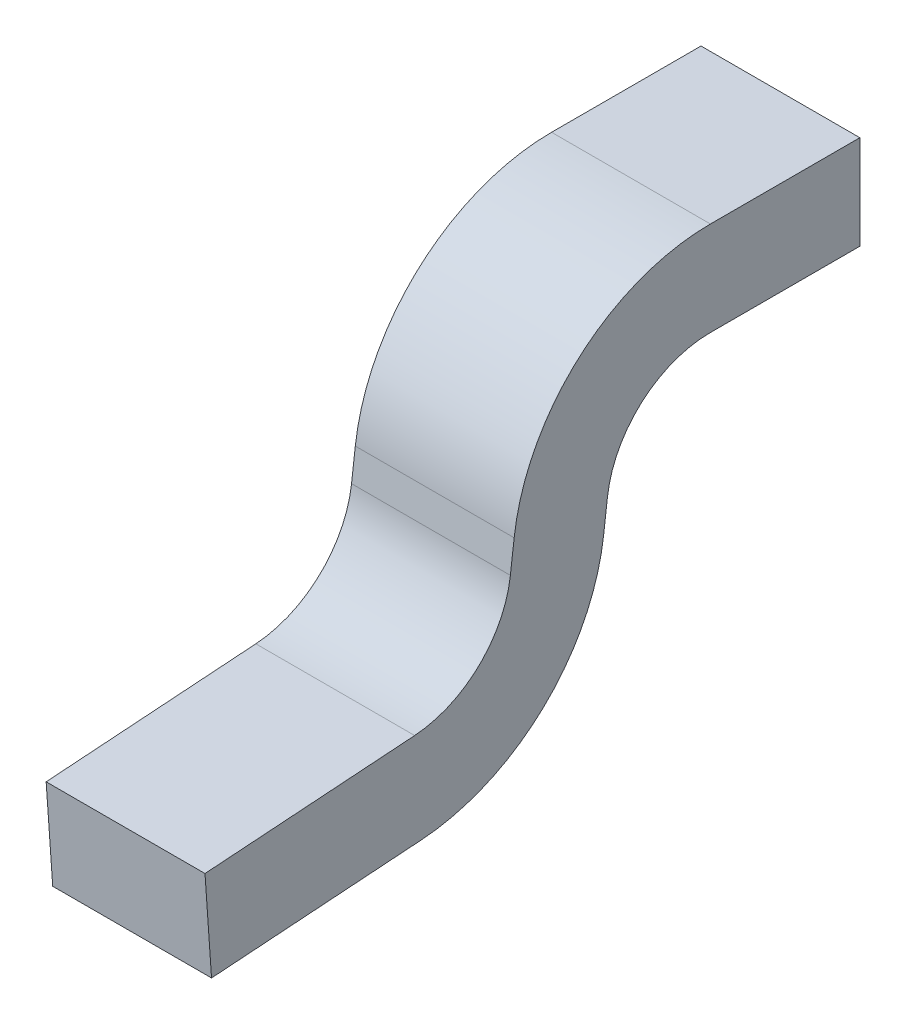
ISO-10303-21;
HEADER;
FILE_DESCRIPTION(('STEP AP214'),'2;1');
FILE_NAME('part.step','',(''),(''),'','','');
FILE_SCHEMA(('AUTOMOTIVE_DESIGN { 1 0 10303 214 1 1 1 1 }'));
ENDSEC;
DATA;
#1=APPLICATION_CONTEXT('core data for automotive mechanical design processes');
#2=APPLICATION_PROTOCOL_DEFINITION('international standard','automotive_design',2000,#1);
#3=PRODUCT_CONTEXT('',#1,'mechanical');
#4=PRODUCT('Part','Part','',(#3));
#5=PRODUCT_RELATED_PRODUCT_CATEGORY('part','',(#4));
#6=PRODUCT_DEFINITION_FORMATION('','',#4);
#7=PRODUCT_DEFINITION_CONTEXT('part definition',#1,'design');
#8=PRODUCT_DEFINITION('design','',#6,#7);
#9=PRODUCT_DEFINITION_SHAPE('','',#8);
#10=(LENGTH_UNIT() NAMED_UNIT(*) SI_UNIT(.MILLI.,.METRE.));
#11=(NAMED_UNIT(*) PLANE_ANGLE_UNIT() SI_UNIT($,.RADIAN.));
#12=(NAMED_UNIT(*) SI_UNIT($,.STERADIAN.) SOLID_ANGLE_UNIT());
#13=UNCERTAINTY_MEASURE_WITH_UNIT(LENGTH_MEASURE(1.E-05),#10,'distance_accuracy_value','');
#14=(GEOMETRIC_REPRESENTATION_CONTEXT(3) GLOBAL_UNCERTAINTY_ASSIGNED_CONTEXT((#13)) GLOBAL_UNIT_ASSIGNED_CONTEXT((#10,
#11,#12)) REPRESENTATION_CONTEXT('',''));
#15=CARTESIAN_POINT('',(0.,0.,0.));
#16=DIRECTION('',(0.,0.,1.));
#17=DIRECTION('',(1.,0.,0.));
#18=AXIS2_PLACEMENT_3D('',#15,#16,#17);
#19=CARTESIAN_POINT('',(0.1225,0.,0.));
#20=DIRECTION('',(1.,0.,0.));
#21=DIRECTION('',(0.,0.,-1.));
#22=AXIS2_PLACEMENT_3D('',#19,#20,#21);
#23=PLANE('',#22);
#24=CARTESIAN_POINT('',(0.1225,0.0675,-0.1694895299344));
#25=DIRECTION('',(-1.,0.,0.));
#26=DIRECTION('',(0.,0.,1.));
#27=AXIS2_PLACEMENT_3D('',#24,#25,#26);
#28=CIRCLE('',#27,0.305);
#29=CARTESIAN_POINT('',(0.1225,0.104670149738584,0.133237046316252));
#30=VERTEX_POINT('',#29);
#31=CARTESIAN_POINT('',(0.1225,0.3725,-0.1694895299344));
#32=VERTEX_POINT('',#31);
#33=EDGE_CURVE('E195',#30,#32,#28,.T.);
#34=ORIENTED_EDGE('',*,*,#33,.F.);
#35=DIRECTION('',(0.,-0.992546151641328,0.121869343405103));
#36=VECTOR('',#35,1.);
#37=CARTESIAN_POINT('',(0.1225,0.01767105479375,0.143919191988));
#38=LINE('',#37,#36);
#39=CARTESIAN_POINT('',(0.1225,0.0573739531898198,0.139044289041878));
#40=VERTEX_POINT('',#39);
#41=EDGE_CURVE('E192',#40,#30,#38,.F.);
#42=ORIENTED_EDGE('',*,*,#41,.F.);
#43=CARTESIAN_POINT('',(0.1225,0.07687304813464,0.2978516733045));
#44=DIRECTION('',(1.,0.,0.));
#45=DIRECTION('',(0.,0.,-1.));
#46=AXIS2_PLACEMENT_3D('',#43,#44,#45);
#47=CIRCLE('',#46,0.16);
#48=CARTESIAN_POINT('',(0.1225,-0.0827371999069275,0.28669063750542));
#49=VERTEX_POINT('',#48);
#50=EDGE_CURVE('E189',#40,#49,#47,.F.);
#51=ORIENTED_EDGE('',*,*,#50,.T.);
#52=DIRECTION('',(0.,-0.0697564737441317,0.997564050259824));
#53=VECTOR('',#52,1.);
#54=CARTESIAN_POINT('',(0.1225,-0.07353675199435,0.1551181024954));
#55=LINE('',#54,#53);
#56=CARTESIAN_POINT('',(0.1225,-0.105353212712308,0.610114688692899));
#57=VERTEX_POINT('',#56);
#58=EDGE_CURVE('E185',#57,#49,#55,.F.);
#59=ORIENTED_EDGE('',*,*,#58,.F.);
#60=DIRECTION('',(0.,-0.997564050259825,-0.0697564737441217));
#61=VECTOR('',#60,1.);
#62=CARTESIAN_POINT('',(0.1225,-0.1053532127123,0.6101146886929));
#63=LINE('',#62,#61);
#64=CARTESIAN_POINT('',(0.1225,-0.25,0.6));
#65=VERTEX_POINT('',#64);
#66=EDGE_CURVE('E125',#65,#57,#63,.F.);
#67=ORIENTED_EDGE('',*,*,#66,.F.);
#68=DIRECTION('',(0.,0.0697564737441317,-0.997564050259824));
#69=VECTOR('',#68,1.);
#70=CARTESIAN_POINT('',(0.1225,-0.25,0.6));
#71=LINE('',#70,#69);
#72=CARTESIAN_POINT('',(0.1225,-0.227383987194604,0.27657594881252));
#73=VERTEX_POINT('',#72);
#74=EDGE_CURVE('E129',#73,#65,#71,.F.);
#75=ORIENTED_EDGE('',*,*,#74,.F.);
#76=CARTESIAN_POINT('',(0.1225,0.07687304813464,0.2978516733045));
#77=DIRECTION('',(-1.,0.,0.));
#78=DIRECTION('',(0.,0.,1.));
#79=AXIS2_PLACEMENT_3D('',#76,#77,#78);
#80=CIRCLE('',#79,0.305);
#81=CARTESIAN_POINT('',(0.1225,0.0397028983960769,-0.00487490294611844));
#82=VERTEX_POINT('',#81);
#83=EDGE_CURVE('E173',#82,#73,#80,.T.);
#84=ORIENTED_EDGE('',*,*,#83,.F.);
#85=DIRECTION('',(0.,0.992546151641328,-0.121869343405103));
#86=VECTOR('',#85,1.);
#87=CARTESIAN_POINT('',(0.1225,-0.2098456333613,0.02576580394965));
#88=LINE('',#87,#86);
#89=CARTESIAN_POINT('',(0.1225,0.0869990949448186,-0.0106821456717666));
#90=VERTEX_POINT('',#89);
#91=EDGE_CURVE('E89',#90,#82,#88,.F.);
#92=ORIENTED_EDGE('',*,*,#91,.F.);
#93=CARTESIAN_POINT('',(0.1225,0.0675,-0.1694895299344));
#94=DIRECTION('',(1.,0.,0.));
#95=DIRECTION('',(0.,0.,-1.));
#96=AXIS2_PLACEMENT_3D('',#93,#94,#95);
#97=CIRCLE('',#96,0.16);
#98=CARTESIAN_POINT('',(0.1225,0.2275,-0.1694895299344));
#99=VERTEX_POINT('',#98);
#100=EDGE_CURVE('E19',#90,#99,#97,.F.);
#101=ORIENTED_EDGE('',*,*,#100,.T.);
#102=DIRECTION('',(0.,0.,-1.));
#103=VECTOR('',#102,1.);
#104=CARTESIAN_POINT('',(0.1225,0.2275,-0.02793348760541));
#105=LINE('',#104,#103);
#106=CARTESIAN_POINT('',(0.1225,0.2275,-0.4));
#107=VERTEX_POINT('',#106);
#108=EDGE_CURVE('E95',#107,#99,#105,.F.);
#109=ORIENTED_EDGE('',*,*,#108,.F.);
#110=DIRECTION('',(0.,1.,0.));
#111=VECTOR('',#110,1.);
#112=CARTESIAN_POINT('',(0.1225,0.2275,-0.4));
#113=LINE('',#112,#111);
#114=CARTESIAN_POINT('',(0.1225,0.3725,-0.4));
#115=VERTEX_POINT('',#114);
#116=EDGE_CURVE('E101',#115,#107,#113,.F.);
#117=ORIENTED_EDGE('',*,*,#116,.F.);
#118=DIRECTION('',(0.,0.,1.));
#119=VECTOR('',#118,1.);
#120=CARTESIAN_POINT('',(0.1225,0.3725,-0.4));
#121=LINE('',#120,#119);
#122=EDGE_CURVE('E107',#32,#115,#121,.F.);
#123=ORIENTED_EDGE('',*,*,#122,.F.);
#124=EDGE_LOOP('',(#34,#42,#51,#59,#67,#75,#84,#92,#101,#109,#117,#123));
#125=FACE_BOUND('',#124,.T.);
#126=ADVANCED_FACE('F16',(#125),#23,.T.);
#127=CARTESIAN_POINT('',(-0.1225,-0.2098456333613,0.02576580394965));
#128=DIRECTION('',(0.,-0.121869343405103,-0.992546151641328));
#129=DIRECTION('',(0.,0.992546151641328,-0.121869343405103));
#130=AXIS2_PLACEMENT_3D('',#127,#128,#129);
#131=PLANE('',#130);
#132=DIRECTION('',(1.,0.,0.));
#133=VECTOR('',#132,1.);
#134=CARTESIAN_POINT('',(-0.1225,0.0869990949448154,-0.0106821456717875));
#135=LINE('',#134,#133);
#136=CARTESIAN_POINT('',(-0.1225,0.0869990949448222,-0.0106821456717693));
#137=VERTEX_POINT('',#136);
#138=EDGE_CURVE('E210',#137,#90,#135,.T.);
#139=ORIENTED_EDGE('',*,*,#138,.T.);
#140=ORIENTED_EDGE('',*,*,#91,.T.);
#141=DIRECTION('',(-1.,0.,0.));
#142=VECTOR('',#141,1.);
#143=CARTESIAN_POINT('',(-0.1225,0.0397028983960738,-0.00487490294610366));
#144=LINE('',#143,#142);
#145=CARTESIAN_POINT('',(-0.1225,0.0397028983960693,-0.00487490294611852));
#146=VERTEX_POINT('',#145);
#147=EDGE_CURVE('E171',#146,#82,#144,.F.);
#148=ORIENTED_EDGE('',*,*,#147,.F.);
#149=DIRECTION('',(0.,0.992546151641321,-0.121869343405153));
#150=VECTOR('',#149,1.);
#151=CARTESIAN_POINT('',(-0.1225,0.03970289839607,-0.004874902946134));
#152=LINE('',#151,#150);
#153=EDGE_CURVE('E168',#146,#137,#152,.T.);
#154=ORIENTED_EDGE('',*,*,#153,.T.);
#155=EDGE_LOOP('',(#139,#140,#148,#154));
#156=FACE_BOUND('',#155,.T.);
#157=ADVANCED_FACE('F256',(#156),#131,.T.);
#158=CARTESIAN_POINT('',(-0.1225,0.0675,-0.1694895299344));
#159=DIRECTION('',(1.,0.,0.));
#160=DIRECTION('',(0.,0.,-1.));
#161=AXIS2_PLACEMENT_3D('',#158,#159,#160);
#162=CYLINDRICAL_SURFACE('',#161,0.16);
#163=ORIENTED_EDGE('',*,*,#138,.F.);
#164=CARTESIAN_POINT('',(-0.1225,0.0675,-0.1694895299344));
#165=DIRECTION('',(1.,0.,0.));
#166=DIRECTION('',(0.,0.,-1.));
#167=AXIS2_PLACEMENT_3D('',#164,#165,#166);
#168=CIRCLE('',#167,0.16);
#169=CARTESIAN_POINT('',(-0.1225,0.2275,-0.1694895299344));
#170=VERTEX_POINT('',#169);
#171=EDGE_CURVE('E165',#137,#170,#168,.F.);
#172=ORIENTED_EDGE('',*,*,#171,.T.);
#173=DIRECTION('',(1.,0.,0.));
#174=VECTOR('',#173,1.);
#175=CARTESIAN_POINT('',(-0.1225,0.2275,-0.1694895299344));
#176=LINE('',#175,#174);
#177=EDGE_CURVE('E208',#99,#170,#176,.F.);
#178=ORIENTED_EDGE('',*,*,#177,.F.);
#179=ORIENTED_EDGE('',*,*,#100,.F.);
#180=EDGE_LOOP('',(#163,#172,#178,#179));
#181=FACE_BOUND('',#180,.T.);
#182=ADVANCED_FACE('F254',(#181),#162,.F.);
#183=CARTESIAN_POINT('',(-0.1225,0.2275,-0.02793348760541));
#184=DIRECTION('',(0.,-1.,0.));
#185=DIRECTION('',(0.,0.,-1.));
#186=AXIS2_PLACEMENT_3D('',#183,#184,#185);
#187=PLANE('',#186);
#188=ORIENTED_EDGE('',*,*,#177,.T.);
#189=DIRECTION('',(0.,0.,-1.));
#190=VECTOR('',#189,1.);
#191=CARTESIAN_POINT('',(-0.1225,0.2275,0.));
#192=LINE('',#191,#190);
#193=CARTESIAN_POINT('',(-0.1225,0.2275,-0.4));
#194=VERTEX_POINT('',#193);
#195=EDGE_CURVE('E162',#170,#194,#192,.T.);
#196=ORIENTED_EDGE('',*,*,#195,.T.);
#197=DIRECTION('',(-1.,0.,0.));
#198=VECTOR('',#197,1.);
#199=CARTESIAN_POINT('',(-0.1225,0.2275,-0.4));
#200=LINE('',#199,#198);
#201=EDGE_CURVE('E204',#107,#194,#200,.T.);
#202=ORIENTED_EDGE('',*,*,#201,.F.);
#203=ORIENTED_EDGE('',*,*,#108,.T.);
#204=EDGE_LOOP('',(#188,#196,#202,#203));
#205=FACE_BOUND('',#204,.T.);
#206=ADVANCED_FACE('F250',(#205),#187,.T.);
#207=CARTESIAN_POINT('',(-0.1225,0.2275,-0.4));
#208=DIRECTION('',(0.,0.,-1.));
#209=DIRECTION('',(-1.,0.,0.));
#210=AXIS2_PLACEMENT_3D('',#207,#208,#209);
#211=PLANE('',#210);
#212=ORIENTED_EDGE('',*,*,#201,.T.);
#213=DIRECTION('',(0.,1.,0.));
#214=VECTOR('',#213,1.);
#215=CARTESIAN_POINT('',(-0.1225,0.,-0.4));
#216=LINE('',#215,#214);
#217=CARTESIAN_POINT('',(-0.1225,0.3725,-0.4));
#218=VERTEX_POINT('',#217);
#219=EDGE_CURVE('E159',#194,#218,#216,.T.);
#220=ORIENTED_EDGE('',*,*,#219,.T.);
#221=DIRECTION('',(1.,0.,0.));
#222=VECTOR('',#221,1.);
#223=CARTESIAN_POINT('',(-0.1225,0.3725,-0.4));
#224=LINE('',#223,#222);
#225=EDGE_CURVE('E196',#115,#218,#224,.F.);
#226=ORIENTED_EDGE('',*,*,#225,.F.);
#227=ORIENTED_EDGE('',*,*,#116,.T.);
#228=EDGE_LOOP('',(#212,#220,#226,#227));
#229=FACE_BOUND('',#228,.T.);
#230=ADVANCED_FACE('F249',(#229),#211,.T.);
#231=CARTESIAN_POINT('',(-0.1225,0.3725,-0.4));
#232=DIRECTION('',(0.,1.,0.));
#233=DIRECTION('',(0.,0.,1.));
#234=AXIS2_PLACEMENT_3D('',#231,#232,#233);
#235=PLANE('',#234);
#236=ORIENTED_EDGE('',*,*,#225,.T.);
#237=DIRECTION('',(0.,0.,-1.));
#238=VECTOR('',#237,1.);
#239=CARTESIAN_POINT('',(-0.1225,0.3725,0.));
#240=LINE('',#239,#238);
#241=CARTESIAN_POINT('',(-0.1225,0.3725,-0.1694895299344));
#242=VERTEX_POINT('',#241);
#243=EDGE_CURVE('E156',#218,#242,#240,.F.);
#244=ORIENTED_EDGE('',*,*,#243,.T.);
#245=DIRECTION('',(-1.,0.,0.));
#246=VECTOR('',#245,1.);
#247=CARTESIAN_POINT('',(-0.1225,0.3725,-0.1694895299344));
#248=LINE('',#247,#246);
#249=EDGE_CURVE('E193',#32,#242,#248,.T.);
#250=ORIENTED_EDGE('',*,*,#249,.F.);
#251=ORIENTED_EDGE('',*,*,#122,.T.);
#252=EDGE_LOOP('',(#236,#244,#250,#251));
#253=FACE_BOUND('',#252,.T.);
#254=ADVANCED_FACE('F244',(#253),#235,.T.);
#255=CARTESIAN_POINT('',(-0.1225,0.0675,-0.1694895299344));
#256=DIRECTION('',(-1.,0.,0.));
#257=DIRECTION('',(0.,0.,1.));
#258=AXIS2_PLACEMENT_3D('',#255,#256,#257);
#259=CYLINDRICAL_SURFACE('',#258,0.305);
#260=CARTESIAN_POINT('',(-0.1225,0.0675,-0.1694895299344));
#261=DIRECTION('',(-1.,0.,0.));
#262=DIRECTION('',(0.,0.,1.));
#263=AXIS2_PLACEMENT_3D('',#260,#261,#262);
#264=CIRCLE('',#263,0.305);
#265=CARTESIAN_POINT('',(-0.1225,0.104670149738842,0.133237046316195));
#266=VERTEX_POINT('',#265);
#267=EDGE_CURVE('E155',#242,#266,#264,.F.);
#268=ORIENTED_EDGE('',*,*,#267,.T.);
#269=DIRECTION('',(1.,0.,0.));
#270=VECTOR('',#269,1.);
#271=CARTESIAN_POINT('',(-0.1225,0.104670149738606,0.13323704631625));
#272=LINE('',#271,#270);
#273=EDGE_CURVE('E190',#30,#266,#272,.F.);
#274=ORIENTED_EDGE('',*,*,#273,.F.);
#275=ORIENTED_EDGE('',*,*,#33,.T.);
#276=ORIENTED_EDGE('',*,*,#249,.T.);
#277=EDGE_LOOP('',(#268,#274,#275,#276));
#278=FACE_BOUND('',#277,.T.);
#279=ADVANCED_FACE('F242',(#278),#259,.T.);
#280=CARTESIAN_POINT('',(-0.1225,0.01767105479375,0.143919191988));
#281=DIRECTION('',(0.,0.121869343405103,0.992546151641328));
#282=DIRECTION('',(0.,-0.992546151641328,0.121869343405103));
#283=AXIS2_PLACEMENT_3D('',#280,#281,#282);
#284=PLANE('',#283);
#285=ORIENTED_EDGE('',*,*,#273,.T.);
#286=DIRECTION('',(0.,-0.992546151641118,0.121869343406813));
#287=VECTOR('',#286,1.);
#288=CARTESIAN_POINT('',(-0.1225,0.1046701497386,0.1332370463162));
#289=LINE('',#288,#287);
#290=CARTESIAN_POINT('',(-0.1225,0.0573739531896849,0.139044289041911));
#291=VERTEX_POINT('',#290);
#292=EDGE_CURVE('E145',#266,#291,#289,.T.);
#293=ORIENTED_EDGE('',*,*,#292,.T.);
#294=DIRECTION('',(1.,0.,0.));
#295=VECTOR('',#294,1.);
#296=CARTESIAN_POINT('',(-0.1225,0.0573739531898186,0.139044289041888));
#297=LINE('',#296,#295);
#298=EDGE_CURVE('E186',#291,#40,#297,.T.);
#299=ORIENTED_EDGE('',*,*,#298,.T.);
#300=ORIENTED_EDGE('',*,*,#41,.T.);
#301=EDGE_LOOP('',(#285,#293,#299,#300));
#302=FACE_BOUND('',#301,.T.);
#303=ADVANCED_FACE('F265',(#302),#284,.T.);
#304=CARTESIAN_POINT('',(-0.1225,0.07687304813464,0.2978516733045));
#305=DIRECTION('',(1.,0.,0.));
#306=DIRECTION('',(0.,0.,-1.));
#307=AXIS2_PLACEMENT_3D('',#304,#305,#306);
#308=CYLINDRICAL_SURFACE('',#307,0.16);
#309=ORIENTED_EDGE('',*,*,#298,.F.);
#310=CARTESIAN_POINT('',(-0.1225,0.07687304813464,0.2978516733045));
#311=DIRECTION('',(1.,0.,0.));
#312=DIRECTION('',(0.,0.,-1.));
#313=AXIS2_PLACEMENT_3D('',#310,#311,#312);
#314=CIRCLE('',#313,0.16);
#315=CARTESIAN_POINT('',(-0.1225,-0.0827371999069299,0.286690637505427));
#316=VERTEX_POINT('',#315);
#317=EDGE_CURVE('E143',#291,#316,#314,.F.);
#318=ORIENTED_EDGE('',*,*,#317,.T.);
#319=DIRECTION('',(1.,0.,0.));
#320=VECTOR('',#319,1.);
#321=CARTESIAN_POINT('',(-0.1225,-0.0827371999069261,0.2866906375054));
#322=LINE('',#321,#320);
#323=EDGE_CURVE('E142',#49,#316,#322,.F.);
#324=ORIENTED_EDGE('',*,*,#323,.F.);
#325=ORIENTED_EDGE('',*,*,#50,.F.);
#326=EDGE_LOOP('',(#309,#318,#324,#325));
#327=FACE_BOUND('',#326,.T.);
#328=ADVANCED_FACE('F263',(#327),#308,.F.);
#329=CARTESIAN_POINT('',(-0.1225,-0.07353675199435,0.1551181024954));
#330=DIRECTION('',(0.,0.997564050259824,0.0697564737441317));
#331=DIRECTION('',(0.,-0.0697564737441317,0.997564050259824));
#332=AXIS2_PLACEMENT_3D('',#329,#330,#331);
#333=PLANE('',#332);
#334=ORIENTED_EDGE('',*,*,#323,.T.);
#335=DIRECTION('',(0.,-0.0697564737440437,0.99756405025983));
#336=VECTOR('',#335,1.);
#337=CARTESIAN_POINT('',(-0.1225,-0.08273719990693,0.2866906375054));
#338=LINE('',#337,#336);
#339=CARTESIAN_POINT('',(-0.1225,-0.1053532127123,0.6101146886929));
#340=VERTEX_POINT('',#339);
#341=EDGE_CURVE('E136',#316,#340,#338,.T.);
#342=ORIENTED_EDGE('',*,*,#341,.T.);
#343=DIRECTION('',(1.,0.,0.));
#344=VECTOR('',#343,1.);
#345=CARTESIAN_POINT('',(-0.1225,-0.1053532127123,0.6101146886929));
#346=LINE('',#345,#344);
#347=EDGE_CURVE('E119',#57,#340,#346,.F.);
#348=ORIENTED_EDGE('',*,*,#347,.F.);
#349=ORIENTED_EDGE('',*,*,#58,.T.);
#350=EDGE_LOOP('',(#334,#342,#348,#349));
#351=FACE_BOUND('',#350,.T.);
#352=ADVANCED_FACE('F140',(#351),#333,.T.);
#353=CARTESIAN_POINT('',(-0.1225,-0.1053532127123,0.6101146886929));
#354=DIRECTION('',(0.,-0.0697564737441217,0.997564050259825));
#355=DIRECTION('',(0.,-0.997564050259825,-0.0697564737441217));
#356=AXIS2_PLACEMENT_3D('',#353,#354,#355);
#357=PLANE('',#356);
#358=ORIENTED_EDGE('',*,*,#347,.T.);
#359=DIRECTION('',(0.,-0.997564050259824,-0.0697564737441256));
#360=VECTOR('',#359,1.);
#361=CARTESIAN_POINT('',(-0.1225,-0.1053532127123,0.6101146886929));
#362=LINE('',#361,#360);
#363=CARTESIAN_POINT('',(-0.1225,-0.25,0.6));
#364=VERTEX_POINT('',#363);
#365=EDGE_CURVE('E123',#340,#364,#362,.T.);
#366=ORIENTED_EDGE('',*,*,#365,.T.);
#367=DIRECTION('',(1.,0.,0.));
#368=VECTOR('',#367,1.);
#369=CARTESIAN_POINT('',(-0.1225,-0.25,0.6));
#370=LINE('',#369,#368);
#371=EDGE_CURVE('E176',#65,#364,#370,.F.);
#372=ORIENTED_EDGE('',*,*,#371,.F.);
#373=ORIENTED_EDGE('',*,*,#66,.T.);
#374=EDGE_LOOP('',(#358,#366,#372,#373));
#375=FACE_BOUND('',#374,.T.);
#376=ADVANCED_FACE('F121',(#375),#357,.T.);
#377=CARTESIAN_POINT('',(-0.1225,-0.25,0.6));
#378=DIRECTION('',(0.,-0.997564050259824,-0.0697564737441317));
#379=DIRECTION('',(0.,0.0697564737441317,-0.997564050259824));
#380=AXIS2_PLACEMENT_3D('',#377,#378,#379);
#381=PLANE('',#380);
#382=ORIENTED_EDGE('',*,*,#371,.T.);
#383=DIRECTION('',(0.,0.0697564737441357,-0.997564050259823));
#384=VECTOR('',#383,1.);
#385=CARTESIAN_POINT('',(-0.1225,-0.25,0.6));
#386=LINE('',#385,#384);
#387=CARTESIAN_POINT('',(-0.1225,-0.227383987194603,0.276575948812519));
#388=VERTEX_POINT('',#387);
#389=EDGE_CURVE('E25',#364,#388,#386,.T.);
#390=ORIENTED_EDGE('',*,*,#389,.T.);
#391=DIRECTION('',(-1.,0.,0.));
#392=VECTOR('',#391,1.);
#393=CARTESIAN_POINT('',(-0.1225,-0.227383987194603,0.2765759488125));
#394=LINE('',#393,#392);
#395=EDGE_CURVE('E33',#73,#388,#394,.T.);
#396=ORIENTED_EDGE('',*,*,#395,.F.);
#397=ORIENTED_EDGE('',*,*,#74,.T.);
#398=EDGE_LOOP('',(#382,#390,#396,#397));
#399=FACE_BOUND('',#398,.T.);
#400=ADVANCED_FACE('F259',(#399),#381,.T.);
#401=CARTESIAN_POINT('',(-0.1225,0.07687304813464,0.2978516733045));
#402=DIRECTION('',(-1.,0.,0.));
#403=DIRECTION('',(0.,0.,1.));
#404=AXIS2_PLACEMENT_3D('',#401,#402,#403);
#405=CYLINDRICAL_SURFACE('',#404,0.305);
#406=CARTESIAN_POINT('',(-0.1225,0.07687304813464,0.2978516733045));
#407=DIRECTION('',(-1.,0.,0.));
#408=DIRECTION('',(0.,0.,1.));
#409=AXIS2_PLACEMENT_3D('',#406,#407,#408);
#410=CIRCLE('',#409,0.305);
#411=EDGE_CURVE('E10',#388,#146,#410,.F.);
#412=ORIENTED_EDGE('',*,*,#411,.T.);
#413=ORIENTED_EDGE('',*,*,#147,.T.);
#414=ORIENTED_EDGE('',*,*,#83,.T.);
#415=ORIENTED_EDGE('',*,*,#395,.T.);
#416=EDGE_LOOP('',(#412,#413,#414,#415));
#417=FACE_BOUND('',#416,.T.);
#418=ADVANCED_FACE('F276',(#417),#405,.T.);
#419=CARTESIAN_POINT('',(-0.1225,0.,0.));
#420=DIRECTION('',(1.,0.,0.));
#421=DIRECTION('',(0.,0.,-1.));
#422=AXIS2_PLACEMENT_3D('',#419,#420,#421);
#423=PLANE('',#422);
#424=ORIENTED_EDGE('',*,*,#389,.F.);
#425=ORIENTED_EDGE('',*,*,#365,.F.);
#426=ORIENTED_EDGE('',*,*,#341,.F.);
#427=ORIENTED_EDGE('',*,*,#317,.F.);
#428=ORIENTED_EDGE('',*,*,#292,.F.);
#429=ORIENTED_EDGE('',*,*,#267,.F.);
#430=ORIENTED_EDGE('',*,*,#243,.F.);
#431=ORIENTED_EDGE('',*,*,#219,.F.);
#432=ORIENTED_EDGE('',*,*,#195,.F.);
#433=ORIENTED_EDGE('',*,*,#171,.F.);
#434=ORIENTED_EDGE('',*,*,#153,.F.);
#435=ORIENTED_EDGE('',*,*,#411,.F.);
#436=EDGE_LOOP('',(#424,#425,#426,#427,#428,#429,#430,#431,#432,#433,#434,#435));
#437=FACE_BOUND('',#436,.T.);
#438=ADVANCED_FACE('F134',(#437),#423,.F.);
#439=CLOSED_SHELL('',(#126,#157,#182,#206,#230,#254,#279,#303,#328,#352,#376,#400,#418,#438));
#440=MANIFOLD_SOLID_BREP('B1',#439);
#441=ADVANCED_BREP_SHAPE_REPRESENTATION('',(#18,#440),#14);
#442=SHAPE_DEFINITION_REPRESENTATION(#9,#441);
ENDSEC;
END-ISO-10303-21;
